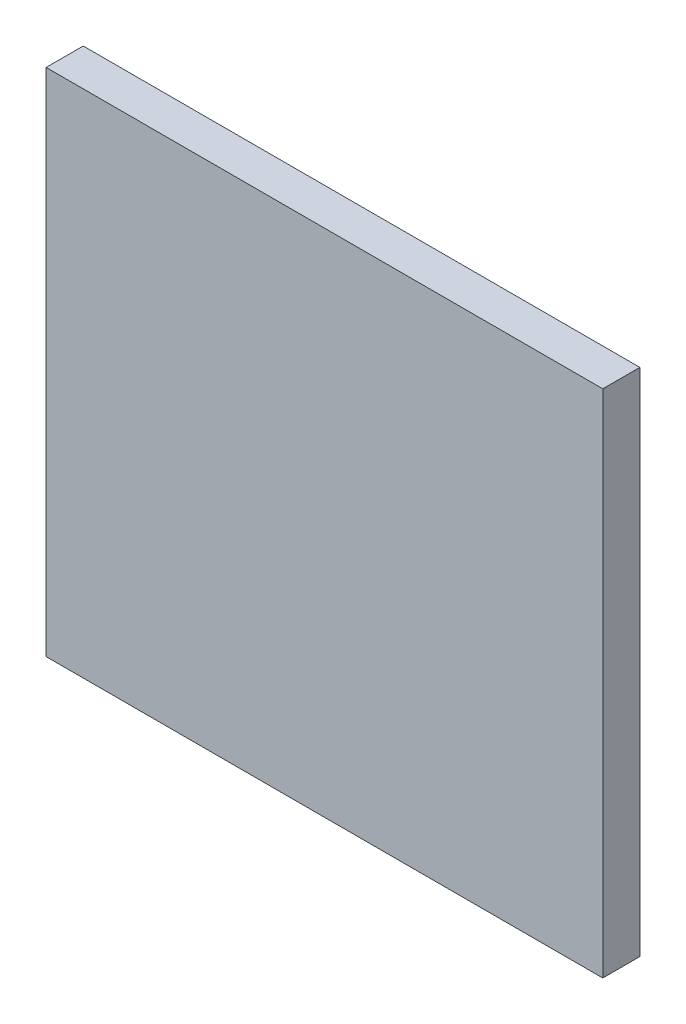
ISO-10303-21;
HEADER;
FILE_DESCRIPTION(('STEP AP214'),'2;1');
FILE_NAME('part.step','',(''),(''),'','','');
FILE_SCHEMA(('AUTOMOTIVE_DESIGN { 1 0 10303 214 1 1 1 1 }'));
ENDSEC;
DATA;
#1=APPLICATION_CONTEXT('core data for automotive mechanical design processes');
#2=APPLICATION_PROTOCOL_DEFINITION('international standard','automotive_design',2000,#1);
#3=PRODUCT_CONTEXT('',#1,'mechanical');
#4=PRODUCT('Part','Part','',(#3));
#5=PRODUCT_RELATED_PRODUCT_CATEGORY('part','',(#4));
#6=PRODUCT_DEFINITION_FORMATION('','',#4);
#7=PRODUCT_DEFINITION_CONTEXT('part definition',#1,'design');
#8=PRODUCT_DEFINITION('design','',#6,#7);
#9=PRODUCT_DEFINITION_SHAPE('','',#8);
#10=(LENGTH_UNIT() NAMED_UNIT(*) SI_UNIT(.MILLI.,.METRE.));
#11=(NAMED_UNIT(*) PLANE_ANGLE_UNIT() SI_UNIT($,.RADIAN.));
#12=(NAMED_UNIT(*) SI_UNIT($,.STERADIAN.) SOLID_ANGLE_UNIT());
#13=UNCERTAINTY_MEASURE_WITH_UNIT(LENGTH_MEASURE(1.E-05),#10,'distance_accuracy_value','');
#14=(GEOMETRIC_REPRESENTATION_CONTEXT(3) GLOBAL_UNCERTAINTY_ASSIGNED_CONTEXT((#13)) GLOBAL_UNIT_ASSIGNED_CONTEXT((#10,
#11,#12)) REPRESENTATION_CONTEXT('',''));
#15=CARTESIAN_POINT('',(0.,0.,0.));
#16=DIRECTION('',(0.,0.,1.));
#17=DIRECTION('',(1.,0.,0.));
#18=AXIS2_PLACEMENT_3D('',#15,#16,#17);
#19=CARTESIAN_POINT('',(-6.,-5.5,0.8));
#20=DIRECTION('',(1.,0.,0.));
#21=DIRECTION('',(0.,0.,-1.));
#22=AXIS2_PLACEMENT_3D('',#19,#20,#21);
#23=PLANE('',#22);
#24=DIRECTION('',(0.,-1.,0.));
#25=VECTOR('',#24,1.);
#26=CARTESIAN_POINT('',(-6.,-5.5,0.));
#27=LINE('',#26,#25);
#28=CARTESIAN_POINT('',(-6.,5.5,0.));
#29=VERTEX_POINT('',#28);
#30=CARTESIAN_POINT('',(-6.,-5.5,0.));
#31=VERTEX_POINT('',#30);
#32=EDGE_CURVE('E100',#29,#31,#27,.T.);
#33=ORIENTED_EDGE('',*,*,#32,.T.);
#34=DIRECTION('',(0.,0.,-1.));
#35=VECTOR('',#34,1.);
#36=CARTESIAN_POINT('',(-6.,-5.5,0.8));
#37=LINE('',#36,#35);
#38=CARTESIAN_POINT('',(-6.,-5.5,0.8));
#39=VERTEX_POINT('',#38);
#40=EDGE_CURVE('E11',#39,#31,#37,.T.);
#41=ORIENTED_EDGE('',*,*,#40,.F.);
#42=DIRECTION('',(0.,-1.,0.));
#43=VECTOR('',#42,1.);
#44=CARTESIAN_POINT('',(-6.,-5.5,0.8));
#45=LINE('',#44,#43);
#46=CARTESIAN_POINT('',(-6.,5.5,0.8));
#47=VERTEX_POINT('',#46);
#48=EDGE_CURVE('E88',#47,#39,#45,.T.);
#49=ORIENTED_EDGE('',*,*,#48,.F.);
#50=DIRECTION('',(0.,0.,-1.));
#51=VECTOR('',#50,1.);
#52=CARTESIAN_POINT('',(-6.,5.5,0.8));
#53=LINE('',#52,#51);
#54=EDGE_CURVE('E96',#47,#29,#53,.T.);
#55=ORIENTED_EDGE('',*,*,#54,.T.);
#56=EDGE_LOOP('',(#33,#41,#49,#55));
#57=FACE_BOUND('',#56,.T.);
#58=ADVANCED_FACE('F37',(#57),#23,.F.);
#59=CARTESIAN_POINT('',(6.,-5.5,0.8));
#60=DIRECTION('',(0.,1.,0.));
#61=DIRECTION('',(-1.,0.,0.));
#62=AXIS2_PLACEMENT_3D('',#59,#60,#61);
#63=PLANE('',#62);
#64=DIRECTION('',(1.,0.,0.));
#65=VECTOR('',#64,1.);
#66=CARTESIAN_POINT('',(6.,-5.5,0.));
#67=LINE('',#66,#65);
#68=CARTESIAN_POINT('',(6.,-5.5,0.));
#69=VERTEX_POINT('',#68);
#70=EDGE_CURVE('E92',#31,#69,#67,.T.);
#71=ORIENTED_EDGE('',*,*,#70,.T.);
#72=DIRECTION('',(0.,0.,-1.));
#73=VECTOR('',#72,1.);
#74=CARTESIAN_POINT('',(6.,-5.5,0.8));
#75=LINE('',#74,#73);
#76=CARTESIAN_POINT('',(6.,-5.5,0.8));
#77=VERTEX_POINT('',#76);
#78=EDGE_CURVE('E45',#77,#69,#75,.T.);
#79=ORIENTED_EDGE('',*,*,#78,.F.);
#80=DIRECTION('',(1.,0.,0.));
#81=VECTOR('',#80,1.);
#82=CARTESIAN_POINT('',(6.,-5.5,0.8));
#83=LINE('',#82,#81);
#84=EDGE_CURVE('E83',#39,#77,#83,.T.);
#85=ORIENTED_EDGE('',*,*,#84,.F.);
#86=ORIENTED_EDGE('',*,*,#40,.T.);
#87=EDGE_LOOP('',(#71,#79,#85,#86));
#88=FACE_BOUND('',#87,.T.);
#89=ADVANCED_FACE('F91',(#88),#63,.F.);
#90=CARTESIAN_POINT('',(6.,-5.5,0.8));
#91=DIRECTION('',(-1.,0.,0.));
#92=DIRECTION('',(0.,0.,1.));
#93=AXIS2_PLACEMENT_3D('',#90,#91,#92);
#94=PLANE('',#93);
#95=DIRECTION('',(0.,1.,0.));
#96=VECTOR('',#95,1.);
#97=CARTESIAN_POINT('',(6.,-5.5,0.));
#98=LINE('',#97,#96);
#99=CARTESIAN_POINT('',(6.,5.5,0.));
#100=VERTEX_POINT('',#99);
#101=EDGE_CURVE('E70',#69,#100,#98,.T.);
#102=ORIENTED_EDGE('',*,*,#101,.T.);
#103=DIRECTION('',(0.,0.,-1.));
#104=VECTOR('',#103,1.);
#105=CARTESIAN_POINT('',(6.,5.5,0.8));
#106=LINE('',#105,#104);
#107=CARTESIAN_POINT('',(6.,5.5,0.8));
#108=VERTEX_POINT('',#107);
#109=EDGE_CURVE('E93',#108,#100,#106,.T.);
#110=ORIENTED_EDGE('',*,*,#109,.F.);
#111=DIRECTION('',(0.,1.,0.));
#112=VECTOR('',#111,1.);
#113=CARTESIAN_POINT('',(6.,-5.5,0.8));
#114=LINE('',#113,#112);
#115=EDGE_CURVE('E86',#77,#108,#114,.T.);
#116=ORIENTED_EDGE('',*,*,#115,.F.);
#117=ORIENTED_EDGE('',*,*,#78,.T.);
#118=EDGE_LOOP('',(#102,#110,#116,#117));
#119=FACE_BOUND('',#118,.T.);
#120=ADVANCED_FACE('F94',(#119),#94,.F.);
#121=CARTESIAN_POINT('',(6.,5.5,0.8));
#122=DIRECTION('',(0.,-1.,0.));
#123=DIRECTION('',(1.,0.,0.));
#124=AXIS2_PLACEMENT_3D('',#121,#122,#123);
#125=PLANE('',#124);
#126=DIRECTION('',(-1.,0.,0.));
#127=VECTOR('',#126,1.);
#128=CARTESIAN_POINT('',(6.,5.5,0.));
#129=LINE('',#128,#127);
#130=EDGE_CURVE('E76',#100,#29,#129,.T.);
#131=ORIENTED_EDGE('',*,*,#130,.T.);
#132=ORIENTED_EDGE('',*,*,#54,.F.);
#133=DIRECTION('',(-1.,0.,0.));
#134=VECTOR('',#133,1.);
#135=CARTESIAN_POINT('',(6.,5.5,0.8));
#136=LINE('',#135,#134);
#137=EDGE_CURVE('E53',#108,#47,#136,.T.);
#138=ORIENTED_EDGE('',*,*,#137,.F.);
#139=ORIENTED_EDGE('',*,*,#109,.T.);
#140=EDGE_LOOP('',(#131,#132,#138,#139));
#141=FACE_BOUND('',#140,.T.);
#142=ADVANCED_FACE('F107',(#141),#125,.F.);
#143=CARTESIAN_POINT('',(0.,0.,0.8));
#144=DIRECTION('',(0.,0.,1.));
#145=DIRECTION('',(1.,0.,0.));
#146=AXIS2_PLACEMENT_3D('',#143,#144,#145);
#147=PLANE('',#146);
#148=ORIENTED_EDGE('',*,*,#48,.T.);
#149=ORIENTED_EDGE('',*,*,#84,.T.);
#150=ORIENTED_EDGE('',*,*,#115,.T.);
#151=ORIENTED_EDGE('',*,*,#137,.T.);
#152=EDGE_LOOP('',(#148,#149,#150,#151));
#153=FACE_BOUND('',#152,.T.);
#154=ADVANCED_FACE('F84',(#153),#147,.T.);
#155=CARTESIAN_POINT('',(0.,0.,0.));
#156=DIRECTION('',(0.,0.,1.));
#157=DIRECTION('',(1.,0.,0.));
#158=AXIS2_PLACEMENT_3D('',#155,#156,#157);
#159=PLANE('',#158);
#160=ORIENTED_EDGE('',*,*,#32,.F.);
#161=ORIENTED_EDGE('',*,*,#130,.F.);
#162=ORIENTED_EDGE('',*,*,#101,.F.);
#163=ORIENTED_EDGE('',*,*,#70,.F.);
#164=EDGE_LOOP('',(#160,#161,#162,#163));
#165=FACE_BOUND('',#164,.T.);
#166=ADVANCED_FACE('F110',(#165),#159,.F.);
#167=CLOSED_SHELL('',(#58,#89,#120,#142,#154,#166));
#168=MANIFOLD_SOLID_BREP('B2',#167);
#169=ADVANCED_BREP_SHAPE_REPRESENTATION('',(#18,#168),#14);
#170=SHAPE_DEFINITION_REPRESENTATION(#9,#169);
ENDSEC;
END-ISO-10303-21;
